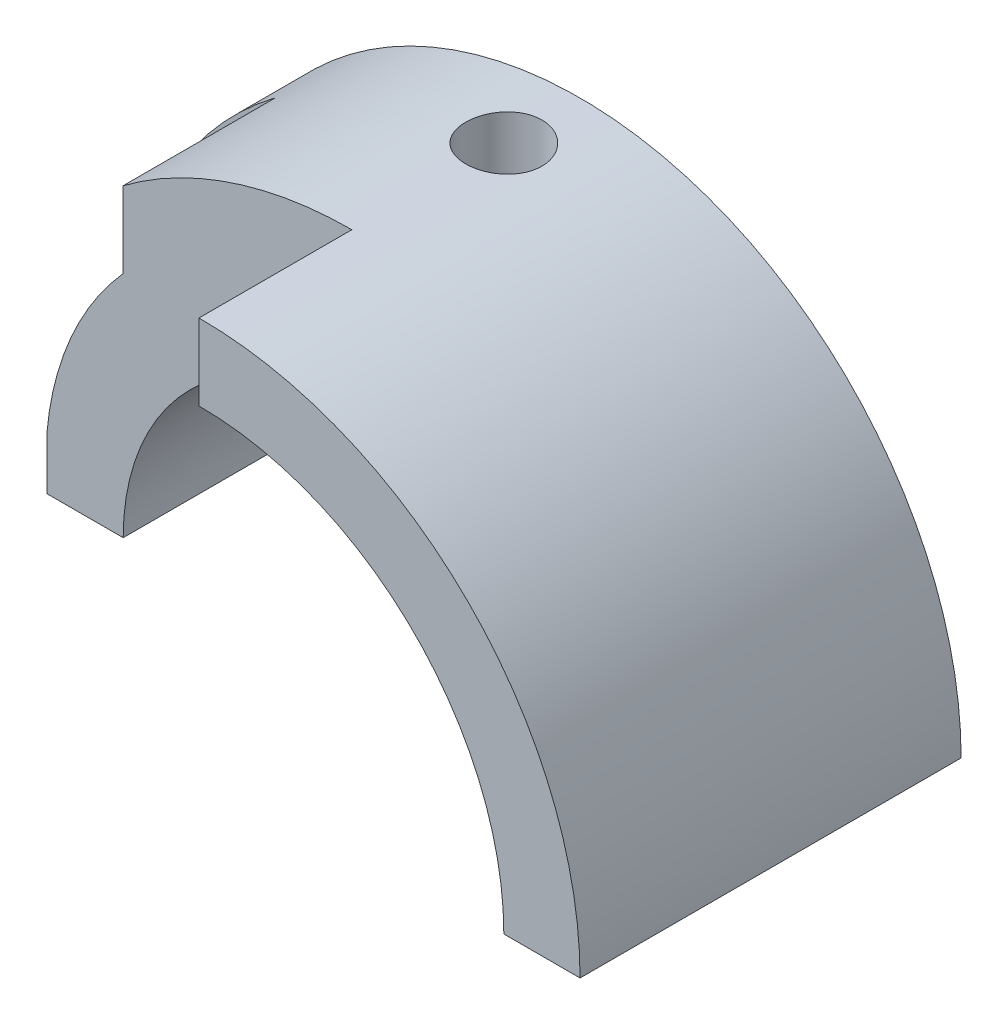
ISO-10303-21;
HEADER;
FILE_DESCRIPTION(('STEP AP214'),'2;1');
FILE_NAME('part.step','',(''),(''),'','','');
FILE_SCHEMA(('AUTOMOTIVE_DESIGN { 1 0 10303 214 1 1 1 1 }'));
ENDSEC;
DATA;
#1=APPLICATION_CONTEXT('core data for automotive mechanical design processes');
#2=APPLICATION_PROTOCOL_DEFINITION('international standard','automotive_design',2000,#1);
#3=PRODUCT_CONTEXT('',#1,'mechanical');
#4=PRODUCT('Part','Part','',(#3));
#5=PRODUCT_RELATED_PRODUCT_CATEGORY('part','',(#4));
#6=PRODUCT_DEFINITION_FORMATION('','',#4);
#7=PRODUCT_DEFINITION_CONTEXT('part definition',#1,'design');
#8=PRODUCT_DEFINITION('design','',#6,#7);
#9=PRODUCT_DEFINITION_SHAPE('','',#8);
#10=(LENGTH_UNIT() NAMED_UNIT(*) SI_UNIT(.MILLI.,.METRE.));
#11=(NAMED_UNIT(*) PLANE_ANGLE_UNIT() SI_UNIT($,.RADIAN.));
#12=(NAMED_UNIT(*) SI_UNIT($,.STERADIAN.) SOLID_ANGLE_UNIT());
#13=UNCERTAINTY_MEASURE_WITH_UNIT(LENGTH_MEASURE(1.E-05),#10,'distance_accuracy_value','');
#14=(GEOMETRIC_REPRESENTATION_CONTEXT(3) GLOBAL_UNCERTAINTY_ASSIGNED_CONTEXT((#13)) GLOBAL_UNIT_ASSIGNED_CONTEXT((#10,
#11,#12)) REPRESENTATION_CONTEXT('',''));
#15=CARTESIAN_POINT('',(0.,0.,0.));
#16=DIRECTION('',(0.,0.,1.));
#17=DIRECTION('',(1.,0.,0.));
#18=AXIS2_PLACEMENT_3D('',#15,#16,#17);
#19=CARTESIAN_POINT('',(0.,0.,5.));
#20=DIRECTION('',(0.,0.,-1.));
#21=DIRECTION('',(-1.,0.,0.));
#22=AXIS2_PLACEMENT_3D('',#19,#20,#21);
#23=CYLINDRICAL_SURFACE('',#22,3.);
#24=CARTESIAN_POINT('',(0.,3.,0.5));
#25=CARTESIAN_POINT('',(0.0278781809916429,2.99999952233765,0.500001117789563));
#26=CARTESIAN_POINT('',(0.0557715763677641,2.99960735582607,0.502339454993784));
#27=CARTESIAN_POINT('',(0.110776044334608,2.99808068988278,0.511627131753065));
#28=CARTESIAN_POINT('',(0.137886373591849,2.99694550784778,0.518580711382321));
#29=CARTESIAN_POINT('',(0.190520949442529,2.9940601364729,0.536883089718551));
#30=CARTESIAN_POINT('',(0.21604647368638,2.99231045031839,0.548228293128115));
#31=CARTESIAN_POINT('',(0.264828368395589,2.98838845416414,0.574982458410479));
#32=CARTESIAN_POINT('',(0.288084997975718,2.98621619250887,0.590390955496599));
#33=CARTESIAN_POINT('',(0.331894522858336,2.98166663491663,0.624991016764092));
#34=CARTESIAN_POINT('',(0.352422580706993,2.97928774362972,0.644213822927226));
#35=CARTESIAN_POINT('',(0.389977699731985,2.97460525375347,0.685829593694562));
#36=CARTESIAN_POINT('',(0.407004539878194,2.97230165992534,0.708222758291322));
#37=CARTESIAN_POINT('',(0.437173425121027,2.96801513151956,0.755714193239411));
#38=CARTESIAN_POINT('',(0.4502909105722,2.96603425818328,0.780828267360951));
#39=CARTESIAN_POINT('',(0.472111673082244,2.96263957958935,0.832941912860125));
#40=CARTESIAN_POINT('',(0.480815248313123,2.96122573602862,0.859941356735526));
#41=CARTESIAN_POINT('',(0.493482875556962,2.95914107368551,0.914796054971308));
#42=CARTESIAN_POINT('',(0.49748980582708,2.9584635369714,0.942641147300278));
#43=CARTESIAN_POINT('',(0.500783345057975,2.9579078778733,0.998616055376694));
#44=CARTESIAN_POINT('',(0.500070288077799,2.95802969891443,1.02674585083346));
#45=CARTESIAN_POINT('',(0.49397901967923,2.95905285772711,1.08218557225509));
#46=CARTESIAN_POINT('',(0.488648976377955,2.95994614663784,1.10950096070905));
#47=CARTESIAN_POINT('',(0.473550628080689,2.96239899042202,1.16284426356583));
#48=CARTESIAN_POINT('',(0.463782170863948,2.96395856814655,1.18887213377771));
#49=CARTESIAN_POINT('',(0.440035449218783,2.9675769586682,1.23904576468818));
#50=CARTESIAN_POINT('',(0.426037182775943,2.96963813421465,1.26318188121625));
#51=CARTESIAN_POINT('',(0.394242403511487,2.97402583683002,1.30878088010768));
#52=CARTESIAN_POINT('',(0.376445584130858,2.97635238530858,1.33024354649099));
#53=CARTESIAN_POINT('',(0.337296442431811,2.98104405575957,1.37016521716147));
#54=CARTESIAN_POINT('',(0.315902792774626,2.98340929846331,1.38858370370802));
#55=CARTESIAN_POINT('',(0.270307049796329,2.98788520279345,1.42157555253307));
#56=CARTESIAN_POINT('',(0.246104938381285,2.98999586277949,1.43614889003665));
#57=CARTESIAN_POINT('',(0.195541183233342,2.99372778578583,1.46104044542726));
#58=CARTESIAN_POINT('',(0.169177745112932,2.9953486368149,1.47135508386625));
#59=CARTESIAN_POINT('',(0.115059669120546,2.99791500602532,1.4873988430492));
#60=CARTESIAN_POINT('',(0.0873051478358936,2.99886058070095,1.49312834739474));
#61=CARTESIAN_POINT('',(0.0315419802603248,2.99996225968537,1.49978427169223));
#62=CARTESIAN_POINT('',(0.00354014743020237,3.00012750602557,1.50076631436112));
#63=CARTESIAN_POINT('',(-0.0522279545779774,2.99967494884234,1.49804773111438));
#64=CARTESIAN_POINT('',(-0.0799942327784077,2.99905717544824,1.49434728537325));
#65=CARTESIAN_POINT('',(-0.134331235109353,2.99711365387641,1.4824150301329));
#66=CARTESIAN_POINT('',(-0.160908173677076,2.99579220960262,1.47421075832198));
#67=CARTESIAN_POINT('',(-0.212309376972088,2.99258892891072,1.45353309636009));
#68=CARTESIAN_POINT('',(-0.237133543181944,2.99070706102404,1.44105946647295));
#69=CARTESIAN_POINT('',(-0.284566137893792,2.98656903260482,1.41206977506064));
#70=CARTESIAN_POINT('',(-0.307153050187429,2.98430971177405,1.39551896876655));
#71=CARTESIAN_POINT('',(-0.349248717100538,2.9796769347838,1.35889253692299));
#72=CARTESIAN_POINT('',(-0.368757247939316,2.9773034703431,1.33881665534467));
#73=CARTESIAN_POINT('',(-0.4043485559316,2.97268035047169,1.29546049038572));
#74=CARTESIAN_POINT('',(-0.420393752222743,2.97043223227421,1.27214916689712));
#75=CARTESIAN_POINT('',(-0.448340462058997,2.96634305955577,1.22312940617229));
#76=CARTESIAN_POINT('',(-0.460242106953965,2.96450199213204,1.1974210449545));
#77=CARTESIAN_POINT('',(-0.47950766629463,2.96144690739541,1.14444205343757));
#78=CARTESIAN_POINT('',(-0.486890286509589,2.96023030862213,1.1171783809939));
#79=CARTESIAN_POINT('',(-0.496967090755655,2.95855543367052,1.06177597415565));
#80=CARTESIAN_POINT('',(-0.499661682389234,2.95809709156545,1.03363731605359));
#81=CARTESIAN_POINT('',(-0.500274573209471,2.95799346616803,0.977658966807518));
#82=CARTESIAN_POINT('',(-0.498252027225037,2.9583381130113,0.949819924284942));
#83=CARTESIAN_POINT('',(-0.48961596779137,2.95977956290746,0.894884150389847));
#84=CARTESIAN_POINT('',(-0.483002469222495,2.96087636352243,0.867787416611626));
#85=CARTESIAN_POINT('',(-0.46539489791898,2.96369471256344,0.815128312541477));
#86=CARTESIAN_POINT('',(-0.454405918120088,2.96541553443934,0.789564197988795));
#87=CARTESIAN_POINT('',(-0.428365400783182,2.96928873784442,0.740632866161031));
#88=CARTESIAN_POINT('',(-0.413313661749713,2.9714411407768,0.717265757925573));
#89=CARTESIAN_POINT('',(-0.379363776874431,2.97596690809125,0.673092883378449));
#90=CARTESIAN_POINT('',(-0.36042211271873,2.97834259115261,0.652320796659946));
#91=CARTESIAN_POINT('',(-0.319321806276046,2.98302874472168,0.614229679105013));
#92=CARTESIAN_POINT('',(-0.297162422582527,2.9853392000531,0.596911446272366));
#93=CARTESIAN_POINT('',(-0.250073833928056,2.98965305928444,0.566110346360011));
#94=CARTESIAN_POINT('',(-0.225126557506564,2.99165423250621,0.55265479213741));
#95=CARTESIAN_POINT('',(-0.173302613875796,2.99510233520355,0.530146103078016));
#96=CARTESIAN_POINT('',(-0.146427898966002,2.99654981635497,0.521088583784061));
#97=CARTESIAN_POINT('',(-0.0995406620090801,2.99841158166591,0.509598945174667));
#98=CARTESIAN_POINT('',(-0.0798117660596894,2.99900405454672,0.506005106076807));
#99=CARTESIAN_POINT('',(-0.0400578620639618,2.99979843197224,0.50120525243105));
#100=CARTESIAN_POINT('',(-0.0200328591216988,3.00000034324129,0.499999196772528));
#101=CARTESIAN_POINT('',(0.,3.,0.5));
#102=B_SPLINE_CURVE_WITH_KNOTS('',3,(#24,#25,#26,#27,#28,#29,#30,#31,#32,#33,#34,#35,#36,#37,
#38,#39,#40,#41,#42,#43,#44,#45,#46,#47,#48,#49,#50,#51,#52,#53,#54,#55,#56,#57,#58,#59,#60,#61,
#62,#63,#64,#65,#66,#67,#68,#69,#70,#71,#72,#73,#74,#75,#76,#77,#78,#79,#80,#81,#82,#83,#84,#85,
#86,#87,#88,#89,#90,#91,#92,#93,#94,#95,#96,#97,#98,#99,#100,#101),.UNSPECIFIED.,.T.,.F.,(4,2,2,
2,2,2,2,2,2,2,2,2,2,2,2,2,2,2,2,2,2,2,2,2,2,2,2,2,2,2,2,2,2,2,2,2,2,2,4),(0.,0.0835613169877018,
0.167199509139084,0.250769373405054,0.334329682534958,0.418604982124664,0.502885600339713,
0.58768504164768,0.672478753752362,0.756492154206847,0.840499608641773,0.923641043520817,
1.00678533005076,1.09032911326511,1.17387964136115,1.25846553982265,1.34305198327169,
1.42770937783181,1.5123596890423,1.59601576698279,1.67966862607172,1.76281561401283,
1.84596727165213,1.92985365125405,2.01374612610857,2.09850764401524,2.18326647475189,
2.26767204468354,2.35207027557324,2.4354158190454,2.51876109237627,2.60200963645244,
2.68526231005867,2.76950276838678,2.85376266775794,2.9386044632144,3.02336150426014,
3.08340849632804,3.14345445455394),.UNSPECIFIED.);
#103=CARTESIAN_POINT('',(0.,3.,0.5));
#104=VERTEX_POINT('',#103);
#105=EDGE_CURVE('E133',#104,#104,#102,.T.);
#106=ORIENTED_EDGE('',*,*,#105,.F.);
#107=EDGE_LOOP('',(#106));
#108=FACE_BOUND('',#107,.T.);
#109=DIRECTION('',(0.,0.,-1.));
#110=VECTOR('',#109,1.);
#111=CARTESIAN_POINT('',(3.,0.,5.));
#112=LINE('',#111,#110);
#113=CARTESIAN_POINT('',(3.,0.,4.));
#114=VERTEX_POINT('',#113);
#115=CARTESIAN_POINT('',(3.,0.,0.));
#116=VERTEX_POINT('',#115);
#117=EDGE_CURVE('E112',#114,#116,#112,.T.);
#118=ORIENTED_EDGE('',*,*,#117,.F.);
#119=CARTESIAN_POINT('',(0.,0.,4.));
#120=DIRECTION('',(0.,0.,-1.));
#121=DIRECTION('',(-1.,0.,0.));
#122=AXIS2_PLACEMENT_3D('',#119,#120,#121);
#123=CIRCLE('',#122,3.);
#124=CARTESIAN_POINT('',(0.,3.,4.));
#125=VERTEX_POINT('',#124);
#126=EDGE_CURVE('E246',#114,#125,#123,.F.);
#127=ORIENTED_EDGE('',*,*,#126,.T.);
#128=DIRECTION('',(0.,0.,-1.));
#129=VECTOR('',#128,1.);
#130=CARTESIAN_POINT('',(0.,3.,5.));
#131=LINE('',#130,#129);
#132=CARTESIAN_POINT('',(0.,3.,2.99454477848604));
#133=VERTEX_POINT('',#132);
#134=EDGE_CURVE('E266',#133,#125,#131,.F.);
#135=ORIENTED_EDGE('',*,*,#134,.F.);
#136=CARTESIAN_POINT('',(0.,0.,2.99454477848604));
#137=DIRECTION('',(0.,0.,1.));
#138=DIRECTION('',(1.,0.,0.));
#139=AXIS2_PLACEMENT_3D('',#136,#137,#138);
#140=CIRCLE('',#139,3.);
#141=CARTESIAN_POINT('',(-3.,0.,2.99454477848604));
#142=VERTEX_POINT('',#141);
#143=EDGE_CURVE('E138',#142,#133,#140,.F.);
#144=ORIENTED_EDGE('',*,*,#143,.F.);
#145=DIRECTION('',(0.,0.,-1.));
#146=VECTOR('',#145,1.);
#147=CARTESIAN_POINT('',(-3.,0.,5.));
#148=LINE('',#147,#146);
#149=CARTESIAN_POINT('',(-3.,0.,0.));
#150=VERTEX_POINT('',#149);
#151=EDGE_CURVE('E91',#142,#150,#148,.T.);
#152=ORIENTED_EDGE('',*,*,#151,.T.);
#153=CARTESIAN_POINT('',(0.,0.,0.));
#154=DIRECTION('',(0.,0.,-1.));
#155=DIRECTION('',(1.,0.,0.));
#156=AXIS2_PLACEMENT_3D('',#153,#154,#155);
#157=CIRCLE('',#156,3.);
#158=EDGE_CURVE('E104',#150,#116,#157,.T.);
#159=ORIENTED_EDGE('',*,*,#158,.T.);
#160=EDGE_LOOP('',(#118,#127,#135,#144,#152,#159));
#161=FACE_BOUND('',#160,.T.);
#162=ADVANCED_FACE('F33',(#108,#161),#23,.F.);
#163=CARTESIAN_POINT('',(0.,0.,5.));
#164=DIRECTION('',(0.,0.,-1.));
#165=DIRECTION('',(-1.,0.,0.));
#166=AXIS2_PLACEMENT_3D('',#163,#164,#165);
#167=CYLINDRICAL_SURFACE('',#166,5.);
#168=CARTESIAN_POINT('',(0.,5.,0.5));
#169=CARTESIAN_POINT('',(-0.0280101768957786,4.99999967760384,0.50000121295019));
#170=CARTESIAN_POINT('',(-0.0560388725838865,4.99976212798103,0.502361634448222));
#171=CARTESIAN_POINT('',(-0.111319199248418,4.99883733797368,0.511742185145214));
#172=CARTESIAN_POINT('',(-0.138569939584414,4.99814960217013,0.518767448012295));
#173=CARTESIAN_POINT('',(-0.191485837726707,4.99640207281535,0.537271120298916));
#174=CARTESIAN_POINT('',(-0.217151942307455,4.99534250400354,0.548746840259237));
#175=CARTESIAN_POINT('',(-0.266188080480203,4.99296978697153,0.575820453965822));
#176=CARTESIAN_POINT('',(-0.289558569389538,4.99165668919066,0.591417528000069));
#177=CARTESIAN_POINT('',(-0.333429775337041,4.98891872170662,0.626351348831137));
#178=CARTESIAN_POINT('',(-0.353921072417446,4.98749350786932,0.645699899701017));
#179=CARTESIAN_POINT('',(-0.391371260715492,4.98469478453131,0.687562267131515));
#180=CARTESIAN_POINT('',(-0.408329988541326,4.98332127742458,0.710076230021194));
#181=CARTESIAN_POINT('',(-0.438266985221808,4.98077795776392,0.75768926584181));
#182=CARTESIAN_POINT('',(-0.45123673272744,4.97960858355452,0.782793722047429));
#183=CARTESIAN_POINT('',(-0.47277319237138,4.97761018773262,0.834837792952489));
#184=CARTESIAN_POINT('',(-0.481340013295645,4.97678115771111,0.861777362291975));
#185=CARTESIAN_POINT('',(-0.493799520800947,4.97556042036488,0.916630900433005));
#186=CARTESIAN_POINT('',(-0.497707826501898,4.97516725199048,0.944541288426104));
#187=CARTESIAN_POINT('',(-0.50078764256768,4.97485821530262,1.00062443169789));
#188=CARTESIAN_POINT('',(-0.499959277435401,4.97494233444373,1.02879718006103));
#189=CARTESIAN_POINT('',(-0.493602140126339,4.97557703449467,1.08449765484666));
#190=CARTESIAN_POINT('',(-0.488090422062276,4.97612592295325,1.11202734966435));
#191=CARTESIAN_POINT('',(-0.472549572075293,4.97762567143709,1.16576898160055));
#192=CARTESIAN_POINT('',(-0.462520379127873,4.97857653689246,1.19198090091252));
#193=CARTESIAN_POINT('',(-0.438210446940754,4.98077504726035,1.24239679364944));
#194=CARTESIAN_POINT('',(-0.42392214135999,4.98202321954078,1.26659709474466));
#195=CARTESIAN_POINT('',(-0.391505013676614,4.98467525866439,1.31226260745594));
#196=CARTESIAN_POINT('',(-0.373376079168253,4.98607913006392,1.33372773899088));
#197=CARTESIAN_POINT('',(-0.333697056206035,4.98889192656494,1.37341269699451));
#198=CARTESIAN_POINT('',(-0.312132239425682,4.99030084666498,1.3916178009404));
#199=CARTESIAN_POINT('',(-0.266244740868556,4.99295914539259,1.42415181645519));
#200=CARTESIAN_POINT('',(-0.2419220559998,4.99420852384128,1.43848072367824));
#201=CARTESIAN_POINT('',(-0.191199052846182,4.99640737833548,1.46285501015513));
#202=CARTESIAN_POINT('',(-0.164798373194952,4.99735680207384,1.47289964240903));
#203=CARTESIAN_POINT('',(-0.110673608664966,4.99884823720704,1.48840945835588));
#204=CARTESIAN_POINT('',(-0.0829495633883002,4.99939026078531,1.49387477899531));
#205=CARTESIAN_POINT('',(-0.027092549545952,5.00000425834155,1.50005215386738));
#206=CARTESIAN_POINT('',(0.00103815105274588,5.00007824133868,1.50078452412625));
#207=CARTESIAN_POINT('',(0.0570218966578497,4.99975320878398,1.49752856847562));
#208=CARTESIAN_POINT('',(0.0848749454102348,4.99935419962234,1.49354030634236));
#209=CARTESIAN_POINT('',(0.139454103417337,4.99812930769597,1.48097315228921));
#210=CARTESIAN_POINT('',(0.16618242448601,4.99730430959019,1.47240377276099));
#211=CARTESIAN_POINT('',(0.217822160691891,4.99531999430304,1.45092741298136));
#212=CARTESIAN_POINT('',(0.242733535078559,4.99416066962627,1.4380203354803));
#213=CARTESIAN_POINT('',(0.290124090086071,4.99163237665211,1.40818458066804));
#214=CARTESIAN_POINT('',(0.312594829874458,4.9902627180172,1.39124255553709));
#215=CARTESIAN_POINT('',(0.354380811655939,4.9874696643476,1.35383696612954));
#216=CARTESIAN_POINT('',(0.373695974424588,4.98604626796485,1.33337331346484));
#217=CARTESIAN_POINT('',(0.408693054943573,4.98330012070377,1.2894167126705));
#218=CARTESIAN_POINT('',(0.424361639339771,4.98197775069487,1.26591312172869));
#219=CARTESIAN_POINT('',(0.451529129371913,4.97958916230445,1.21659631992666));
#220=CARTESIAN_POINT('',(0.463028092026941,4.97852294042019,1.1907831406558));
#221=CARTESIAN_POINT('',(0.481507604342237,4.97676973817024,1.1376256302671));
#222=CARTESIAN_POINT('',(0.488496087405931,4.97608209224894,1.11028407995444));
#223=CARTESIAN_POINT('',(0.497782003564731,4.97516182641438,1.05480840101961));
#224=CARTESIAN_POINT('',(0.500079571199758,4.97492919345093,1.02667429515216));
#225=CARTESIAN_POINT('',(0.499916569235628,4.97494556553781,0.970544655821648));
#226=CARTESIAN_POINT('',(0.497476944796556,4.97519245043504,0.942549058558593));
#227=CARTESIAN_POINT('',(0.487952726481826,4.97613551944773,0.887367541415856));
#228=CARTESIAN_POINT('',(0.48086812738108,4.97683170406859,0.86018162244701));
#229=CARTESIAN_POINT('',(0.462260843148752,4.97859434131593,0.807391325476072));
#230=CARTESIAN_POINT('',(0.450738772170458,4.9796607427018,0.781786729185138));
#231=CARTESIAN_POINT('',(0.423585777455522,4.98204375919679,0.732871554164483));
#232=CARTESIAN_POINT('',(0.407954876727708,4.98336037290475,0.709560962589685));
#233=CARTESIAN_POINT('',(0.372949278142666,4.98610243604849,0.665788162764032));
#234=CARTESIAN_POINT('',(0.353558974445134,4.98752832363375,0.645338461816457));
#235=CARTESIAN_POINT('',(0.311615849612555,4.99032427364391,0.607973883650171));
#236=CARTESIAN_POINT('',(0.289062272054128,4.99169432261488,0.591059854321415));
#237=CARTESIAN_POINT('',(0.241370717080645,4.99422781034581,0.56121327307269));
#238=CARTESIAN_POINT('',(0.216226374673382,4.99539072013406,0.548290854527409));
#239=CARTESIAN_POINT('',(0.164129139550275,4.99737314624948,0.526868788588066));
#240=CARTESIAN_POINT('',(0.137178324912805,4.99819304954827,0.518364154523226));
#241=CARTESIAN_POINT('',(0.0917291307028522,4.99919106886867,0.508139691457599));
#242=CARTESIAN_POINT('',(0.0735212764222545,4.99949300345916,0.505091477850321));
#243=CARTESIAN_POINT('',(0.0368782904086565,4.99989757475393,0.501021236969119));
#244=CARTESIAN_POINT('',(0.0184431596132789,5.00000021228012,0.499999201339069));
#245=CARTESIAN_POINT('',(0.,5.,0.5));
#246=B_SPLINE_CURVE_WITH_KNOTS('',3,(#168,#169,#170,#171,#172,#173,#174,#175,#176,#177,#178,
#179,#180,#181,#182,#183,#184,#185,#186,#187,#188,#189,#190,#191,#192,#193,#194,#195,#196,#197,
#198,#199,#200,#201,#202,#203,#204,#205,#206,#207,#208,#209,#210,#211,#212,#213,#214,#215,#216,
#217,#218,#219,#220,#221,#222,#223,#224,#225,#226,#227,#228,#229,#230,#231,#232,#233,#234,#235,
#236,#237,#238,#239,#240,#241,#242,#243,#244,#245),.UNSPECIFIED.,.T.,.F.,(4,2,2,2,2,2,2,2,2,2,2,
2,2,2,2,2,2,2,2,2,2,2,2,2,2,2,2,2,2,2,2,2,2,2,2,2,2,2,4),(0.,0.0839631831342368,
0.168018921417743,0.252023942866101,0.336012268791391,0.420269284311472,0.504530196103529,
0.588969877361109,0.67340747221252,0.757561160225983,0.841712636278883,0.925558987205552,
1.00940647080817,1.09340380686447,1.17740360165563,1.26177367098103,1.34614383489886,
1.43052870346791,1.5149110483772,1.59893094303879,1.68294970259572,1.76679467647152,
1.85064153024733,1.93476970374349,2.01889998905115,2.10333321804299,2.18776529237687,
2.27204845296502,2.35632919619793,2.44023814646978,2.5241471911302,2.608044626814,
2.6919415926948,2.77619458713827,2.86046776318479,2.94495315513121,3.02934297397647,
3.08462833616174,3.13991347034514),.UNSPECIFIED.);
#247=CARTESIAN_POINT('',(0.,5.,0.5));
#248=VERTEX_POINT('',#247);
#249=EDGE_CURVE('E41',#248,#248,#246,.T.);
#250=ORIENTED_EDGE('',*,*,#249,.F.);
#251=EDGE_LOOP('',(#250));
#252=FACE_BOUND('',#251,.T.);
#253=CARTESIAN_POINT('',(0.,0.,0.994544778486042));
#254=DIRECTION('',(0.,0.,1.));
#255=DIRECTION('',(1.,0.,0.));
#256=AXIS2_PLACEMENT_3D('',#253,#254,#255);
#257=CIRCLE('',#256,5.00000000000003);
#258=CARTESIAN_POINT('',(-3.00126205933148,3.99905314433522,0.994544778486042));
#259=VERTEX_POINT('',#258);
#260=CARTESIAN_POINT('',(-5.,0.,0.994544778486042));
#261=VERTEX_POINT('',#260);
#262=EDGE_CURVE('E221',#259,#261,#257,.T.);
#263=ORIENTED_EDGE('',*,*,#262,.F.);
#264=DIRECTION('',(0.,0.,1.));
#265=VECTOR('',#264,1.);
#266=CARTESIAN_POINT('',(-3.00126205933148,3.99905314433522,0.994544778486042));
#267=LINE('',#266,#265);
#268=CARTESIAN_POINT('',(-3.00126205933148,3.99905314433522,2.99454477848604));
#269=VERTEX_POINT('',#268);
#270=EDGE_CURVE('E214',#259,#269,#267,.T.);
#271=ORIENTED_EDGE('',*,*,#270,.T.);
#272=CARTESIAN_POINT('',(0.,0.,2.99454477848604));
#273=DIRECTION('',(0.,0.,1.));
#274=DIRECTION('',(1.,0.,0.));
#275=AXIS2_PLACEMENT_3D('',#272,#273,#274);
#276=CIRCLE('',#275,5.);
#277=CARTESIAN_POINT('',(0.,5.,2.99454477848604));
#278=VERTEX_POINT('',#277);
#279=EDGE_CURVE('E268',#278,#269,#276,.T.);
#280=ORIENTED_EDGE('',*,*,#279,.F.);
#281=DIRECTION('',(0.,0.,-1.));
#282=VECTOR('',#281,1.);
#283=CARTESIAN_POINT('',(0.,5.,2.99454477848604));
#284=LINE('',#283,#282);
#285=CARTESIAN_POINT('',(0.,5.,5.));
#286=VERTEX_POINT('',#285);
#287=EDGE_CURVE('E250',#286,#278,#284,.T.);
#288=ORIENTED_EDGE('',*,*,#287,.F.);
#289=CARTESIAN_POINT('',(0.,0.,5.));
#290=DIRECTION('',(0.,0.,1.));
#291=DIRECTION('',(1.,0.,0.));
#292=AXIS2_PLACEMENT_3D('',#289,#290,#291);
#293=CIRCLE('',#292,5.);
#294=CARTESIAN_POINT('',(5.,0.,5.));
#295=VERTEX_POINT('',#294);
#296=EDGE_CURVE('E106',#295,#286,#293,.T.);
#297=ORIENTED_EDGE('',*,*,#296,.F.);
#298=DIRECTION('',(0.,0.,-1.));
#299=VECTOR('',#298,1.);
#300=CARTESIAN_POINT('',(5.,0.,5.));
#301=LINE('',#300,#299);
#302=CARTESIAN_POINT('',(5.,0.,0.));
#303=VERTEX_POINT('',#302);
#304=EDGE_CURVE('E90',#295,#303,#301,.T.);
#305=ORIENTED_EDGE('',*,*,#304,.T.);
#306=CARTESIAN_POINT('',(0.,0.,0.));
#307=DIRECTION('',(0.,0.,1.));
#308=DIRECTION('',(1.,0.,0.));
#309=AXIS2_PLACEMENT_3D('',#306,#307,#308);
#310=CIRCLE('',#309,5.);
#311=CARTESIAN_POINT('',(-5.,0.,0.));
#312=VERTEX_POINT('',#311);
#313=EDGE_CURVE('E95',#303,#312,#310,.T.);
#314=ORIENTED_EDGE('',*,*,#313,.T.);
#315=DIRECTION('',(0.,0.,-1.));
#316=VECTOR('',#315,1.);
#317=CARTESIAN_POINT('',(-5.,0.,5.));
#318=LINE('',#317,#316);
#319=EDGE_CURVE('E76',#261,#312,#318,.T.);
#320=ORIENTED_EDGE('',*,*,#319,.F.);
#321=EDGE_LOOP('',(#263,#271,#280,#288,#297,#305,#314,#320));
#322=FACE_BOUND('',#321,.T.);
#323=ADVANCED_FACE('F96',(#252,#322),#167,.T.);
#324=CARTESIAN_POINT('',(-5.,0.,5.));
#325=DIRECTION('',(0.,1.,0.));
#326=DIRECTION('',(0.,0.,1.));
#327=AXIS2_PLACEMENT_3D('',#324,#325,#326);
#328=PLANE('',#327);
#329=DIRECTION('',(0.,0.,-1.));
#330=VECTOR('',#329,1.);
#331=CARTESIAN_POINT('',(-4.00126205933148,0.,1.));
#332=LINE('',#331,#330);
#333=CARTESIAN_POINT('',(-4.00126205933148,0.,2.99454477848604));
#334=VERTEX_POINT('',#333);
#335=CARTESIAN_POINT('',(-4.00126205933148,0.,1.));
#336=VERTEX_POINT('',#335);
#337=EDGE_CURVE('E253',#334,#336,#332,.T.);
#338=ORIENTED_EDGE('',*,*,#337,.T.);
#339=DIRECTION('',(0.,0.,1.));
#340=VECTOR('',#339,1.);
#341=CARTESIAN_POINT('',(-4.00126205933148,0.,0.994544778486042));
#342=LINE('',#341,#340);
#343=CARTESIAN_POINT('',(-4.00126205933148,0.,0.994544778486042));
#344=VERTEX_POINT('',#343);
#345=EDGE_CURVE('E231',#344,#336,#342,.T.);
#346=ORIENTED_EDGE('',*,*,#345,.F.);
#347=DIRECTION('',(1.,0.,0.));
#348=VECTOR('',#347,1.);
#349=CARTESIAN_POINT('',(-5.,0.,0.994544778486042));
#350=LINE('',#349,#348);
#351=EDGE_CURVE('E87',#261,#344,#350,.T.);
#352=ORIENTED_EDGE('',*,*,#351,.F.);
#353=ORIENTED_EDGE('',*,*,#319,.T.);
#354=DIRECTION('',(1.,0.,0.));
#355=VECTOR('',#354,1.);
#356=CARTESIAN_POINT('',(-5.,0.,0.));
#357=LINE('',#356,#355);
#358=EDGE_CURVE('E82',#312,#150,#357,.T.);
#359=ORIENTED_EDGE('',*,*,#358,.T.);
#360=ORIENTED_EDGE('',*,*,#151,.F.);
#361=DIRECTION('',(-1.,0.,0.));
#362=VECTOR('',#361,1.);
#363=CARTESIAN_POINT('',(-4.00126205933148,0.,2.99454477848604));
#364=LINE('',#363,#362);
#365=EDGE_CURVE('E156',#142,#334,#364,.T.);
#366=ORIENTED_EDGE('',*,*,#365,.T.);
#367=EDGE_LOOP('',(#338,#346,#352,#353,#359,#360,#366));
#368=FACE_BOUND('',#367,.T.);
#369=ADVANCED_FACE('F79',(#368),#328,.F.);
#370=CARTESIAN_POINT('',(0.,0.,5.));
#371=DIRECTION('',(0.,0.,1.));
#372=DIRECTION('',(1.,0.,0.));
#373=AXIS2_PLACEMENT_3D('',#370,#371,#372);
#374=PLANE('',#373);
#375=CARTESIAN_POINT('',(0.,0.,5.));
#376=DIRECTION('',(0.,0.,1.));
#377=DIRECTION('',(-1.,0.,0.));
#378=AXIS2_PLACEMENT_3D('',#375,#376,#377);
#379=CIRCLE('',#378,4.00000000000001);
#380=CARTESIAN_POINT('',(4.,0.,5.));
#381=VERTEX_POINT('',#380);
#382=CARTESIAN_POINT('',(0.,4.,5.));
#383=VERTEX_POINT('',#382);
#384=EDGE_CURVE('E236',#381,#383,#379,.T.);
#385=ORIENTED_EDGE('',*,*,#384,.F.);
#386=DIRECTION('',(1.,0.,0.));
#387=VECTOR('',#386,1.);
#388=CARTESIAN_POINT('',(3.,0.,5.));
#389=LINE('',#388,#387);
#390=EDGE_CURVE('E57',#381,#295,#389,.T.);
#391=ORIENTED_EDGE('',*,*,#390,.T.);
#392=ORIENTED_EDGE('',*,*,#296,.T.);
#393=DIRECTION('',(0.,-1.,0.));
#394=VECTOR('',#393,1.);
#395=CARTESIAN_POINT('',(0.,5.,5.));
#396=LINE('',#395,#394);
#397=EDGE_CURVE('E263',#286,#383,#396,.T.);
#398=ORIENTED_EDGE('',*,*,#397,.T.);
#399=EDGE_LOOP('',(#385,#391,#392,#398));
#400=FACE_BOUND('',#399,.T.);
#401=ADVANCED_FACE('F129',(#400),#374,.T.);
#402=CARTESIAN_POINT('',(3.,0.,5.));
#403=DIRECTION('',(0.,1.,0.));
#404=DIRECTION('',(0.,0.,1.));
#405=AXIS2_PLACEMENT_3D('',#402,#403,#404);
#406=PLANE('',#405);
#407=ORIENTED_EDGE('',*,*,#390,.F.);
#408=DIRECTION('',(0.,0.,1.));
#409=VECTOR('',#408,1.);
#410=CARTESIAN_POINT('',(4.,0.,4.));
#411=LINE('',#410,#409);
#412=CARTESIAN_POINT('',(4.,0.,4.));
#413=VERTEX_POINT('',#412);
#414=EDGE_CURVE('E244',#413,#381,#411,.T.);
#415=ORIENTED_EDGE('',*,*,#414,.F.);
#416=DIRECTION('',(1.,0.,0.));
#417=VECTOR('',#416,1.);
#418=CARTESIAN_POINT('',(0.,0.,4.));
#419=LINE('',#418,#417);
#420=EDGE_CURVE('E240',#114,#413,#419,.T.);
#421=ORIENTED_EDGE('',*,*,#420,.F.);
#422=ORIENTED_EDGE('',*,*,#117,.T.);
#423=DIRECTION('',(1.,0.,0.));
#424=VECTOR('',#423,1.);
#425=CARTESIAN_POINT('',(3.,0.,0.));
#426=LINE('',#425,#424);
#427=EDGE_CURVE('E100',#116,#303,#426,.T.);
#428=ORIENTED_EDGE('',*,*,#427,.T.);
#429=ORIENTED_EDGE('',*,*,#304,.F.);
#430=EDGE_LOOP('',(#407,#415,#421,#422,#428,#429));
#431=FACE_BOUND('',#430,.T.);
#432=ADVANCED_FACE('F143',(#431),#406,.F.);
#433=CARTESIAN_POINT('',(0.,0.,0.));
#434=DIRECTION('',(0.,0.,1.));
#435=DIRECTION('',(1.,0.,0.));
#436=AXIS2_PLACEMENT_3D('',#433,#434,#435);
#437=PLANE('',#436);
#438=ORIENTED_EDGE('',*,*,#158,.F.);
#439=ORIENTED_EDGE('',*,*,#358,.F.);
#440=ORIENTED_EDGE('',*,*,#313,.F.);
#441=ORIENTED_EDGE('',*,*,#427,.F.);
#442=EDGE_LOOP('',(#438,#439,#440,#441));
#443=FACE_BOUND('',#442,.T.);
#444=ADVANCED_FACE('F102',(#443),#437,.F.);
#445=CARTESIAN_POINT('',(0.,5.,1.));
#446=DIRECTION('',(0.,-1.,0.));
#447=DIRECTION('',(0.,0.,-1.));
#448=AXIS2_PLACEMENT_3D('',#445,#446,#447);
#449=CYLINDRICAL_SURFACE('',#448,0.5);
#450=ORIENTED_EDGE('',*,*,#249,.T.);
#451=EDGE_LOOP('',(#450));
#452=FACE_BOUND('',#451,.T.);
#453=ORIENTED_EDGE('',*,*,#105,.T.);
#454=EDGE_LOOP('',(#453));
#455=FACE_BOUND('',#454,.T.);
#456=ADVANCED_FACE('F120',(#452,#455),#449,.F.);
#457=CARTESIAN_POINT('',(-4.00126205933148,5.,2.99454477848604));
#458=DIRECTION('',(0.,0.,1.));
#459=DIRECTION('',(1.,0.,0.));
#460=AXIS2_PLACEMENT_3D('',#457,#458,#459);
#461=PLANE('',#460);
#462=CARTESIAN_POINT('',(-0.0259539929797783,0.341563977882767,2.99454477848604));
#463=DIRECTION('',(0.,0.,-1.));
#464=DIRECTION('',(-1.,0.,0.));
#465=AXIS2_PLACEMENT_3D('',#462,#463,#464);
#466=CIRCLE('',#465,3.98995490869107);
#467=CARTESIAN_POINT('',(-4.00126205933148,0.683127955765532,2.99454477848604));
#468=VERTEX_POINT('',#467);
#469=CARTESIAN_POINT('',(-3.00126205933148,3.,2.99454477848604));
#470=VERTEX_POINT('',#469);
#471=EDGE_CURVE('E211',#468,#470,#466,.T.);
#472=ORIENTED_EDGE('',*,*,#471,.F.);
#473=DIRECTION('',(0.,-1.,0.));
#474=VECTOR('',#473,1.);
#475=CARTESIAN_POINT('',(-4.00126205933148,5.,2.99454477848604));
#476=LINE('',#475,#474);
#477=EDGE_CURVE('E258',#468,#334,#476,.T.);
#478=ORIENTED_EDGE('',*,*,#477,.T.);
#479=ORIENTED_EDGE('',*,*,#365,.F.);
#480=ORIENTED_EDGE('',*,*,#143,.T.);
#481=DIRECTION('',(0.,-1.,0.));
#482=VECTOR('',#481,1.);
#483=CARTESIAN_POINT('',(0.,5.,2.99454477848604));
#484=LINE('',#483,#482);
#485=EDGE_CURVE('E260',#278,#133,#484,.T.);
#486=ORIENTED_EDGE('',*,*,#485,.F.);
#487=ORIENTED_EDGE('',*,*,#279,.T.);
#488=DIRECTION('',(0.,1.,0.));
#489=VECTOR('',#488,1.);
#490=CARTESIAN_POINT('',(-3.00126205933148,3.,2.99454477848604));
#491=LINE('',#490,#489);
#492=EDGE_CURVE('E224',#470,#269,#491,.T.);
#493=ORIENTED_EDGE('',*,*,#492,.F.);
#494=EDGE_LOOP('',(#472,#478,#479,#480,#486,#487,#493));
#495=FACE_BOUND('',#494,.T.);
#496=ADVANCED_FACE('F125',(#495),#461,.T.);
#497=CARTESIAN_POINT('',(-4.00126205933148,5.,1.));
#498=DIRECTION('',(-1.,0.,0.));
#499=DIRECTION('',(0.,0.,1.));
#500=AXIS2_PLACEMENT_3D('',#497,#498,#499);
#501=PLANE('',#500);
#502=DIRECTION('',(0.,0.,1.));
#503=VECTOR('',#502,1.);
#504=CARTESIAN_POINT('',(-4.00126205933148,0.683127955765532,0.994544778486042));
#505=LINE('',#504,#503);
#506=CARTESIAN_POINT('',(-4.00126205933148,0.683127955765532,1.));
#507=VERTEX_POINT('',#506);
#508=EDGE_CURVE('E233',#507,#468,#505,.T.);
#509=ORIENTED_EDGE('',*,*,#508,.F.);
#510=DIRECTION('',(0.,-1.,0.));
#511=VECTOR('',#510,1.);
#512=CARTESIAN_POINT('',(-4.00126205933148,5.,1.));
#513=LINE('',#512,#511);
#514=EDGE_CURVE('E252',#507,#336,#513,.T.);
#515=ORIENTED_EDGE('',*,*,#514,.T.);
#516=ORIENTED_EDGE('',*,*,#337,.F.);
#517=ORIENTED_EDGE('',*,*,#477,.F.);
#518=EDGE_LOOP('',(#509,#515,#516,#517));
#519=FACE_BOUND('',#518,.T.);
#520=ADVANCED_FACE('F310',(#519),#501,.T.);
#521=CARTESIAN_POINT('',(-5.,5.,1.));
#522=DIRECTION('',(0.,0.,1.));
#523=DIRECTION('',(1.,0.,0.));
#524=AXIS2_PLACEMENT_3D('',#521,#522,#523);
#525=PLANE('',#524);
#526=CARTESIAN_POINT('',(-0.0259539929797783,0.341563977882767,1.));
#527=DIRECTION('',(0.,0.,1.));
#528=DIRECTION('',(1.,0.,0.));
#529=AXIS2_PLACEMENT_3D('',#526,#527,#528);
#530=CIRCLE('',#529,3.98995490869107);
#531=EDGE_CURVE('E11',#336,#507,#530,.F.);
#532=ORIENTED_EDGE('',*,*,#531,.F.);
#533=ORIENTED_EDGE('',*,*,#514,.F.);
#534=EDGE_LOOP('',(#532,#533));
#535=FACE_BOUND('',#534,.T.);
#536=ADVANCED_FACE('F320',(#535),#525,.T.);
#537=CARTESIAN_POINT('',(0.,5.,2.99454477848604));
#538=DIRECTION('',(-1.,0.,0.));
#539=DIRECTION('',(0.,0.,1.));
#540=AXIS2_PLACEMENT_3D('',#537,#538,#539);
#541=PLANE('',#540);
#542=DIRECTION('',(0.,0.,1.));
#543=VECTOR('',#542,1.);
#544=CARTESIAN_POINT('',(0.,4.,4.));
#545=LINE('',#544,#543);
#546=CARTESIAN_POINT('',(0.,4.,4.));
#547=VERTEX_POINT('',#546);
#548=EDGE_CURVE('E242',#547,#383,#545,.T.);
#549=ORIENTED_EDGE('',*,*,#548,.T.);
#550=ORIENTED_EDGE('',*,*,#397,.F.);
#551=ORIENTED_EDGE('',*,*,#287,.T.);
#552=ORIENTED_EDGE('',*,*,#485,.T.);
#553=ORIENTED_EDGE('',*,*,#134,.T.);
#554=DIRECTION('',(0.,-1.,0.));
#555=VECTOR('',#554,1.);
#556=CARTESIAN_POINT('',(0.,4.,4.));
#557=LINE('',#556,#555);
#558=EDGE_CURVE('E238',#547,#125,#557,.T.);
#559=ORIENTED_EDGE('',*,*,#558,.F.);
#560=EDGE_LOOP('',(#549,#550,#551,#552,#553,#559));
#561=FACE_BOUND('',#560,.T.);
#562=ADVANCED_FACE('F127',(#561),#541,.T.);
#563=CARTESIAN_POINT('',(0.,0.,4.));
#564=DIRECTION('',(0.,0.,-1.));
#565=DIRECTION('',(-1.,0.,0.));
#566=AXIS2_PLACEMENT_3D('',#563,#564,#565);
#567=PLANE('',#566);
#568=ORIENTED_EDGE('',*,*,#420,.T.);
#569=CARTESIAN_POINT('',(0.,0.,4.));
#570=DIRECTION('',(0.,0.,1.));
#571=DIRECTION('',(-1.,0.,0.));
#572=AXIS2_PLACEMENT_3D('',#569,#570,#571);
#573=CIRCLE('',#572,4.00000000000001);
#574=EDGE_CURVE('E48',#413,#547,#573,.T.);
#575=ORIENTED_EDGE('',*,*,#574,.T.);
#576=ORIENTED_EDGE('',*,*,#558,.T.);
#577=ORIENTED_EDGE('',*,*,#126,.F.);
#578=EDGE_LOOP('',(#568,#575,#576,#577));
#579=FACE_BOUND('',#578,.T.);
#580=ADVANCED_FACE('F275',(#579),#567,.F.);
#581=CARTESIAN_POINT('',(0.,0.,4.));
#582=DIRECTION('',(0.,0.,1.));
#583=DIRECTION('',(1.,0.,0.));
#584=AXIS2_PLACEMENT_3D('',#581,#582,#583);
#585=CYLINDRICAL_SURFACE('',#584,4.00000000000001);
#586=ORIENTED_EDGE('',*,*,#384,.T.);
#587=ORIENTED_EDGE('',*,*,#548,.F.);
#588=ORIENTED_EDGE('',*,*,#574,.F.);
#589=ORIENTED_EDGE('',*,*,#414,.T.);
#590=EDGE_LOOP('',(#586,#587,#588,#589));
#591=FACE_BOUND('',#590,.T.);
#592=ADVANCED_FACE('F278',(#591),#585,.F.);
#593=CARTESIAN_POINT('',(-0.0259539929797783,0.341563977882767,0.994544778486042));
#594=DIRECTION('',(0.,0.,1.));
#595=DIRECTION('',(1.,0.,0.));
#596=AXIS2_PLACEMENT_3D('',#593,#594,#595);
#597=CYLINDRICAL_SURFACE('',#596,3.98995490869107);
#598=ORIENTED_EDGE('',*,*,#508,.T.);
#599=ORIENTED_EDGE('',*,*,#471,.T.);
#600=DIRECTION('',(0.,0.,1.));
#601=VECTOR('',#600,1.);
#602=CARTESIAN_POINT('',(-3.00126205933148,3.,0.994544778486042));
#603=LINE('',#602,#601);
#604=CARTESIAN_POINT('',(-3.00126205933148,3.,0.994544778486042));
#605=VERTEX_POINT('',#604);
#606=EDGE_CURVE('E205',#605,#470,#603,.T.);
#607=ORIENTED_EDGE('',*,*,#606,.F.);
#608=CARTESIAN_POINT('',(-0.0259539929797783,0.341563977882767,0.994544778486042));
#609=DIRECTION('',(0.,0.,-1.));
#610=DIRECTION('',(-1.,0.,0.));
#611=AXIS2_PLACEMENT_3D('',#608,#609,#610);
#612=CIRCLE('',#611,3.98995490869107);
#613=EDGE_CURVE('E209',#344,#605,#612,.T.);
#614=ORIENTED_EDGE('',*,*,#613,.F.);
#615=ORIENTED_EDGE('',*,*,#345,.T.);
#616=ORIENTED_EDGE('',*,*,#531,.T.);
#617=EDGE_LOOP('',(#598,#599,#607,#614,#615,#616));
#618=FACE_BOUND('',#617,.T.);
#619=ADVANCED_FACE('F207',(#618),#597,.T.);
#620=CARTESIAN_POINT('',(-3.00126205933148,3.,0.994544778486042));
#621=DIRECTION('',(1.,0.,0.));
#622=DIRECTION('',(0.,0.,-1.));
#623=AXIS2_PLACEMENT_3D('',#620,#621,#622);
#624=PLANE('',#623);
#625=ORIENTED_EDGE('',*,*,#492,.T.);
#626=ORIENTED_EDGE('',*,*,#270,.F.);
#627=DIRECTION('',(0.,1.,0.));
#628=VECTOR('',#627,1.);
#629=CARTESIAN_POINT('',(-3.00126205933148,3.,0.994544778486042));
#630=LINE('',#629,#628);
#631=EDGE_CURVE('E217',#605,#259,#630,.T.);
#632=ORIENTED_EDGE('',*,*,#631,.F.);
#633=ORIENTED_EDGE('',*,*,#606,.T.);
#634=EDGE_LOOP('',(#625,#626,#632,#633));
#635=FACE_BOUND('',#634,.T.);
#636=ADVANCED_FACE('F218',(#635),#624,.F.);
#637=CARTESIAN_POINT('',(-0.0259539929797783,0.341563977882767,0.994544778486042));
#638=DIRECTION('',(0.,0.,-1.));
#639=DIRECTION('',(-1.,0.,0.));
#640=AXIS2_PLACEMENT_3D('',#637,#638,#639);
#641=PLANE('',#640);
#642=ORIENTED_EDGE('',*,*,#613,.T.);
#643=ORIENTED_EDGE('',*,*,#631,.T.);
#644=ORIENTED_EDGE('',*,*,#262,.T.);
#645=ORIENTED_EDGE('',*,*,#351,.T.);
#646=EDGE_LOOP('',(#642,#643,#644,#645));
#647=FACE_BOUND('',#646,.T.);
#648=ADVANCED_FACE('F223',(#647),#641,.F.);
#649=CLOSED_SHELL('',(#162,#323,#369,#401,#432,#444,#456,#496,#520,#536,#562,#580,#592,#619,
#636,#648));
#650=MANIFOLD_SOLID_BREP('B2',#649);
#651=ADVANCED_BREP_SHAPE_REPRESENTATION('',(#18,#650),#14);
#652=SHAPE_DEFINITION_REPRESENTATION(#9,#651);
ENDSEC;
END-ISO-10303-21;
